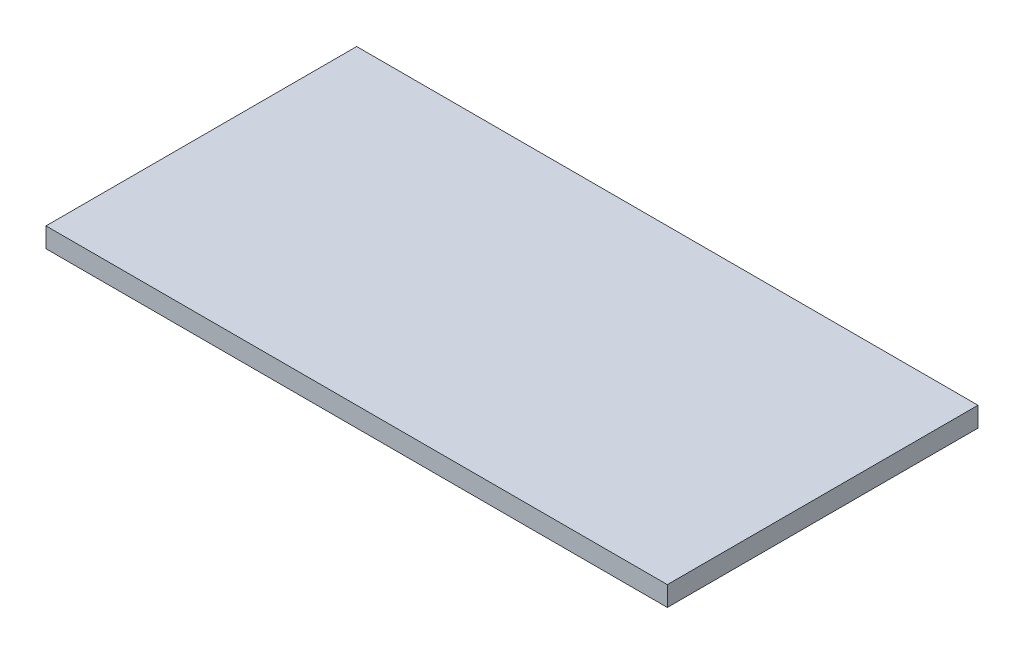
ISO-10303-21;
HEADER;
FILE_DESCRIPTION(('STEP AP214'),'2;1');
FILE_NAME('part.step','',(''),(''),'','','');
FILE_SCHEMA(('AUTOMOTIVE_DESIGN { 1 0 10303 214 1 1 1 1 }'));
ENDSEC;
DATA;
#1=APPLICATION_CONTEXT('core data for automotive mechanical design processes');
#2=APPLICATION_PROTOCOL_DEFINITION('international standard','automotive_design',2000,#1);
#3=PRODUCT_CONTEXT('',#1,'mechanical');
#4=PRODUCT('Part','Part','',(#3));
#5=PRODUCT_RELATED_PRODUCT_CATEGORY('part','',(#4));
#6=PRODUCT_DEFINITION_FORMATION('','',#4);
#7=PRODUCT_DEFINITION_CONTEXT('part definition',#1,'design');
#8=PRODUCT_DEFINITION('design','',#6,#7);
#9=PRODUCT_DEFINITION_SHAPE('','',#8);
#10=(LENGTH_UNIT() NAMED_UNIT(*) SI_UNIT(.MILLI.,.METRE.));
#11=(NAMED_UNIT(*) PLANE_ANGLE_UNIT() SI_UNIT($,.RADIAN.));
#12=(NAMED_UNIT(*) SI_UNIT($,.STERADIAN.) SOLID_ANGLE_UNIT());
#13=UNCERTAINTY_MEASURE_WITH_UNIT(LENGTH_MEASURE(1.E-05),#10,'distance_accuracy_value','');
#14=(GEOMETRIC_REPRESENTATION_CONTEXT(3) GLOBAL_UNCERTAINTY_ASSIGNED_CONTEXT((#13)) GLOBAL_UNIT_ASSIGNED_CONTEXT((#10,
#11,#12)) REPRESENTATION_CONTEXT('',''));
#15=CARTESIAN_POINT('',(0.,0.,0.));
#16=DIRECTION('',(0.,0.,1.));
#17=DIRECTION('',(1.,0.,0.));
#18=AXIS2_PLACEMENT_3D('',#15,#16,#17);
#19=CARTESIAN_POINT('',(-282.,18.,141.));
#20=DIRECTION('',(1.,0.,0.));
#21=DIRECTION('',(0.,0.,-1.));
#22=AXIS2_PLACEMENT_3D('',#19,#20,#21);
#23=PLANE('',#22);
#24=DIRECTION('',(0.,0.,1.));
#25=VECTOR('',#24,1.);
#26=CARTESIAN_POINT('',(-282.,0.,141.));
#27=LINE('',#26,#25);
#28=CARTESIAN_POINT('',(-282.,0.,-141.));
#29=VERTEX_POINT('',#28);
#30=CARTESIAN_POINT('',(-282.,0.,141.));
#31=VERTEX_POINT('',#30);
#32=EDGE_CURVE('E98',#29,#31,#27,.T.);
#33=ORIENTED_EDGE('',*,*,#32,.T.);
#34=DIRECTION('',(0.,-1.,0.));
#35=VECTOR('',#34,1.);
#36=CARTESIAN_POINT('',(-282.,18.,141.));
#37=LINE('',#36,#35);
#38=CARTESIAN_POINT('',(-282.,18.,141.));
#39=VERTEX_POINT('',#38);
#40=EDGE_CURVE('E11',#39,#31,#37,.T.);
#41=ORIENTED_EDGE('',*,*,#40,.F.);
#42=DIRECTION('',(0.,0.,1.));
#43=VECTOR('',#42,1.);
#44=CARTESIAN_POINT('',(-282.,18.,141.));
#45=LINE('',#44,#43);
#46=CARTESIAN_POINT('',(-282.,18.,-141.));
#47=VERTEX_POINT('',#46);
#48=EDGE_CURVE('E86',#47,#39,#45,.T.);
#49=ORIENTED_EDGE('',*,*,#48,.F.);
#50=DIRECTION('',(0.,-1.,0.));
#51=VECTOR('',#50,1.);
#52=CARTESIAN_POINT('',(-282.,18.,-141.));
#53=LINE('',#52,#51);
#54=EDGE_CURVE('E94',#47,#29,#53,.T.);
#55=ORIENTED_EDGE('',*,*,#54,.T.);
#56=EDGE_LOOP('',(#33,#41,#49,#55));
#57=FACE_BOUND('',#56,.T.);
#58=ADVANCED_FACE('F35',(#57),#23,.F.);
#59=CARTESIAN_POINT('',(282.,18.,141.));
#60=DIRECTION('',(0.,0.,-1.));
#61=DIRECTION('',(-1.,0.,0.));
#62=AXIS2_PLACEMENT_3D('',#59,#60,#61);
#63=PLANE('',#62);
#64=DIRECTION('',(1.,0.,0.));
#65=VECTOR('',#64,1.);
#66=CARTESIAN_POINT('',(282.,0.,141.));
#67=LINE('',#66,#65);
#68=CARTESIAN_POINT('',(282.,0.,141.));
#69=VERTEX_POINT('',#68);
#70=EDGE_CURVE('E90',#31,#69,#67,.T.);
#71=ORIENTED_EDGE('',*,*,#70,.T.);
#72=DIRECTION('',(0.,-1.,0.));
#73=VECTOR('',#72,1.);
#74=CARTESIAN_POINT('',(282.,18.,141.));
#75=LINE('',#74,#73);
#76=CARTESIAN_POINT('',(282.,18.,141.));
#77=VERTEX_POINT('',#76);
#78=EDGE_CURVE('E43',#77,#69,#75,.T.);
#79=ORIENTED_EDGE('',*,*,#78,.F.);
#80=DIRECTION('',(1.,0.,0.));
#81=VECTOR('',#80,1.);
#82=CARTESIAN_POINT('',(282.,18.,141.));
#83=LINE('',#82,#81);
#84=EDGE_CURVE('E81',#39,#77,#83,.T.);
#85=ORIENTED_EDGE('',*,*,#84,.F.);
#86=ORIENTED_EDGE('',*,*,#40,.T.);
#87=EDGE_LOOP('',(#71,#79,#85,#86));
#88=FACE_BOUND('',#87,.T.);
#89=ADVANCED_FACE('F89',(#88),#63,.F.);
#90=CARTESIAN_POINT('',(282.,18.,141.));
#91=DIRECTION('',(-1.,0.,0.));
#92=DIRECTION('',(0.,0.,1.));
#93=AXIS2_PLACEMENT_3D('',#90,#91,#92);
#94=PLANE('',#93);
#95=DIRECTION('',(0.,0.,-1.));
#96=VECTOR('',#95,1.);
#97=CARTESIAN_POINT('',(282.,0.,141.));
#98=LINE('',#97,#96);
#99=CARTESIAN_POINT('',(282.,0.,-141.));
#100=VERTEX_POINT('',#99);
#101=EDGE_CURVE('E68',#69,#100,#98,.T.);
#102=ORIENTED_EDGE('',*,*,#101,.T.);
#103=DIRECTION('',(0.,-1.,0.));
#104=VECTOR('',#103,1.);
#105=CARTESIAN_POINT('',(282.,18.,-141.));
#106=LINE('',#105,#104);
#107=CARTESIAN_POINT('',(282.,18.,-141.));
#108=VERTEX_POINT('',#107);
#109=EDGE_CURVE('E91',#108,#100,#106,.T.);
#110=ORIENTED_EDGE('',*,*,#109,.F.);
#111=DIRECTION('',(0.,0.,-1.));
#112=VECTOR('',#111,1.);
#113=CARTESIAN_POINT('',(282.,18.,141.));
#114=LINE('',#113,#112);
#115=EDGE_CURVE('E84',#77,#108,#114,.T.);
#116=ORIENTED_EDGE('',*,*,#115,.F.);
#117=ORIENTED_EDGE('',*,*,#78,.T.);
#118=EDGE_LOOP('',(#102,#110,#116,#117));
#119=FACE_BOUND('',#118,.T.);
#120=ADVANCED_FACE('F92',(#119),#94,.F.);
#121=CARTESIAN_POINT('',(282.,18.,-141.));
#122=DIRECTION('',(0.,0.,1.));
#123=DIRECTION('',(1.,0.,0.));
#124=AXIS2_PLACEMENT_3D('',#121,#122,#123);
#125=PLANE('',#124);
#126=DIRECTION('',(-1.,0.,0.));
#127=VECTOR('',#126,1.);
#128=CARTESIAN_POINT('',(282.,0.,-141.));
#129=LINE('',#128,#127);
#130=EDGE_CURVE('E74',#100,#29,#129,.T.);
#131=ORIENTED_EDGE('',*,*,#130,.T.);
#132=ORIENTED_EDGE('',*,*,#54,.F.);
#133=DIRECTION('',(-1.,0.,0.));
#134=VECTOR('',#133,1.);
#135=CARTESIAN_POINT('',(282.,18.,-141.));
#136=LINE('',#135,#134);
#137=EDGE_CURVE('E51',#108,#47,#136,.T.);
#138=ORIENTED_EDGE('',*,*,#137,.F.);
#139=ORIENTED_EDGE('',*,*,#109,.T.);
#140=EDGE_LOOP('',(#131,#132,#138,#139));
#141=FACE_BOUND('',#140,.T.);
#142=ADVANCED_FACE('F105',(#141),#125,.F.);
#143=CARTESIAN_POINT('',(0.,18.,0.));
#144=DIRECTION('',(0.,1.,0.));
#145=DIRECTION('',(0.,0.,1.));
#146=AXIS2_PLACEMENT_3D('',#143,#144,#145);
#147=PLANE('',#146);
#148=ORIENTED_EDGE('',*,*,#48,.T.);
#149=ORIENTED_EDGE('',*,*,#84,.T.);
#150=ORIENTED_EDGE('',*,*,#115,.T.);
#151=ORIENTED_EDGE('',*,*,#137,.T.);
#152=EDGE_LOOP('',(#148,#149,#150,#151));
#153=FACE_BOUND('',#152,.T.);
#154=ADVANCED_FACE('F82',(#153),#147,.T.);
#155=CARTESIAN_POINT('',(0.,0.,0.));
#156=DIRECTION('',(0.,1.,0.));
#157=DIRECTION('',(0.,0.,1.));
#158=AXIS2_PLACEMENT_3D('',#155,#156,#157);
#159=PLANE('',#158);
#160=ORIENTED_EDGE('',*,*,#32,.F.);
#161=ORIENTED_EDGE('',*,*,#130,.F.);
#162=ORIENTED_EDGE('',*,*,#101,.F.);
#163=ORIENTED_EDGE('',*,*,#70,.F.);
#164=EDGE_LOOP('',(#160,#161,#162,#163));
#165=FACE_BOUND('',#164,.T.);
#166=ADVANCED_FACE('F108',(#165),#159,.F.);
#167=CLOSED_SHELL('',(#58,#89,#120,#142,#154,#166));
#168=MANIFOLD_SOLID_BREP('B2',#167);
#169=ADVANCED_BREP_SHAPE_REPRESENTATION('',(#18,#168),#14);
#170=SHAPE_DEFINITION_REPRESENTATION(#9,#169);
ENDSEC;
END-ISO-10303-21;
